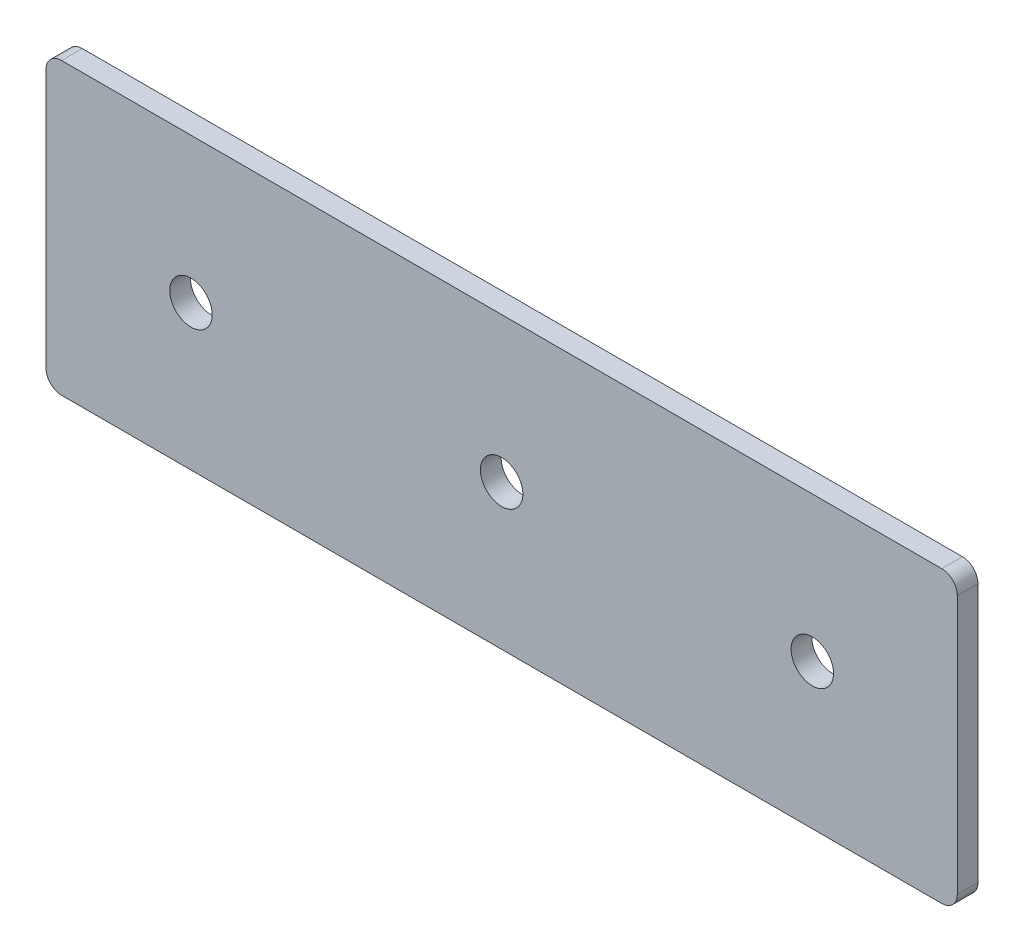
ISO-10303-21;
HEADER;
FILE_DESCRIPTION(('STEP AP214'),'2;1');
FILE_NAME('part.step','',(''),(''),'','','');
FILE_SCHEMA(('AUTOMOTIVE_DESIGN { 1 0 10303 214 1 1 1 1 }'));
ENDSEC;
DATA;
#1=APPLICATION_CONTEXT('core data for automotive mechanical design processes');
#2=APPLICATION_PROTOCOL_DEFINITION('international standard','automotive_design',2000,#1);
#3=PRODUCT_CONTEXT('',#1,'mechanical');
#4=PRODUCT('Part','Part','',(#3));
#5=PRODUCT_RELATED_PRODUCT_CATEGORY('part','',(#4));
#6=PRODUCT_DEFINITION_FORMATION('','',#4);
#7=PRODUCT_DEFINITION_CONTEXT('part definition',#1,'design');
#8=PRODUCT_DEFINITION('design','',#6,#7);
#9=PRODUCT_DEFINITION_SHAPE('','',#8);
#10=(LENGTH_UNIT() NAMED_UNIT(*) SI_UNIT(.MILLI.,.METRE.));
#11=(NAMED_UNIT(*) PLANE_ANGLE_UNIT() SI_UNIT($,.RADIAN.));
#12=(NAMED_UNIT(*) SI_UNIT($,.STERADIAN.) SOLID_ANGLE_UNIT());
#13=UNCERTAINTY_MEASURE_WITH_UNIT(LENGTH_MEASURE(1.E-05),#10,'distance_accuracy_value','');
#14=(GEOMETRIC_REPRESENTATION_CONTEXT(3) GLOBAL_UNCERTAINTY_ASSIGNED_CONTEXT((#13)) GLOBAL_UNIT_ASSIGNED_CONTEXT((#10,
#11,#12)) REPRESENTATION_CONTEXT('',''));
#15=CARTESIAN_POINT('',(0.,0.,0.));
#16=DIRECTION('',(0.,0.,1.));
#17=DIRECTION('',(1.,0.,0.));
#18=AXIS2_PLACEMENT_3D('',#15,#16,#17);
#19=CARTESIAN_POINT('',(0.,0.,4.));
#20=DIRECTION('',(0.,0.,1.));
#21=DIRECTION('',(1.,0.,0.));
#22=AXIS2_PLACEMENT_3D('',#19,#20,#21);
#23=PLANE('',#22);
#24=CARTESIAN_POINT('',(60.,0.,4.));
#25=DIRECTION('',(0.,0.,1.));
#26=DIRECTION('',(1.,0.,0.));
#27=AXIS2_PLACEMENT_3D('',#24,#25,#26);
#28=CIRCLE('',#27,4.09999999999999);
#29=CARTESIAN_POINT('',(64.1,0.,4.));
#30=VERTEX_POINT('',#29);
#31=EDGE_CURVE('E162',#30,#30,#28,.T.);
#32=ORIENTED_EDGE('',*,*,#31,.F.);
#33=EDGE_LOOP('',(#32));
#34=FACE_BOUND('',#33,.T.);
#35=DIRECTION('',(0.,-1.,0.));
#36=VECTOR('',#35,1.);
#37=CARTESIAN_POINT('',(-28.,28.,4.));
#38=LINE('',#37,#36);
#39=CARTESIAN_POINT('',(-28.,25.,4.));
#40=VERTEX_POINT('',#39);
#41=CARTESIAN_POINT('',(-28.,-25.,4.));
#42=VERTEX_POINT('',#41);
#43=EDGE_CURVE('E119',#40,#42,#38,.T.);
#44=ORIENTED_EDGE('',*,*,#43,.T.);
#45=CARTESIAN_POINT('',(-25.,-25.,4.));
#46=DIRECTION('',(0.,0.,1.));
#47=DIRECTION('',(1.,0.,0.));
#48=AXIS2_PLACEMENT_3D('',#45,#46,#47);
#49=CIRCLE('',#48,3.);
#50=CARTESIAN_POINT('',(-25.,-28.,4.));
#51=VERTEX_POINT('',#50);
#52=EDGE_CURVE('E134',#42,#51,#49,.T.);
#53=ORIENTED_EDGE('',*,*,#52,.T.);
#54=DIRECTION('',(1.,0.,0.));
#55=VECTOR('',#54,1.);
#56=CARTESIAN_POINT('',(-28.,-28.,4.));
#57=LINE('',#56,#55);
#58=CARTESIAN_POINT('',(145.,-28.,4.));
#59=VERTEX_POINT('',#58);
#60=EDGE_CURVE('E101',#51,#59,#57,.T.);
#61=ORIENTED_EDGE('',*,*,#60,.T.);
#62=CARTESIAN_POINT('',(145.,-25.,4.));
#63=DIRECTION('',(0.,0.,1.));
#64=DIRECTION('',(1.,0.,0.));
#65=AXIS2_PLACEMENT_3D('',#62,#63,#64);
#66=CIRCLE('',#65,3.);
#67=CARTESIAN_POINT('',(148.,-25.,4.));
#68=VERTEX_POINT('',#67);
#69=EDGE_CURVE('E132',#59,#68,#66,.T.);
#70=ORIENTED_EDGE('',*,*,#69,.T.);
#71=DIRECTION('',(0.,1.,0.));
#72=VECTOR('',#71,1.);
#73=CARTESIAN_POINT('',(148.,28.,4.));
#74=LINE('',#73,#72);
#75=CARTESIAN_POINT('',(148.,25.,4.));
#76=VERTEX_POINT('',#75);
#77=EDGE_CURVE('E145',#68,#76,#74,.T.);
#78=ORIENTED_EDGE('',*,*,#77,.T.);
#79=CARTESIAN_POINT('',(145.,25.,4.));
#80=DIRECTION('',(0.,0.,1.));
#81=DIRECTION('',(1.,0.,0.));
#82=AXIS2_PLACEMENT_3D('',#79,#80,#81);
#83=CIRCLE('',#82,3.);
#84=CARTESIAN_POINT('',(145.,28.,4.));
#85=VERTEX_POINT('',#84);
#86=EDGE_CURVE('E36',#76,#85,#83,.T.);
#87=ORIENTED_EDGE('',*,*,#86,.T.);
#88=DIRECTION('',(-1.,0.,0.));
#89=VECTOR('',#88,1.);
#90=CARTESIAN_POINT('',(-28.,28.,4.));
#91=LINE('',#90,#89);
#92=CARTESIAN_POINT('',(-25.,28.,4.));
#93=VERTEX_POINT('',#92);
#94=EDGE_CURVE('E120',#85,#93,#91,.T.);
#95=ORIENTED_EDGE('',*,*,#94,.T.);
#96=CARTESIAN_POINT('',(-25.,25.,4.));
#97=DIRECTION('',(0.,0.,1.));
#98=DIRECTION('',(1.,0.,0.));
#99=AXIS2_PLACEMENT_3D('',#96,#97,#98);
#100=CIRCLE('',#99,3.);
#101=EDGE_CURVE('E129',#93,#40,#100,.T.);
#102=ORIENTED_EDGE('',*,*,#101,.T.);
#103=EDGE_LOOP('',(#44,#53,#61,#70,#78,#87,#95,#102));
#104=FACE_BOUND('',#103,.T.);
#105=CARTESIAN_POINT('',(0.,0.,4.));
#106=DIRECTION('',(0.,0.,1.));
#107=DIRECTION('',(1.,0.,0.));
#108=AXIS2_PLACEMENT_3D('',#105,#106,#107);
#109=CIRCLE('',#108,4.1);
#110=CARTESIAN_POINT('',(4.1,0.,4.));
#111=VERTEX_POINT('',#110);
#112=EDGE_CURVE('E114',#111,#111,#109,.T.);
#113=ORIENTED_EDGE('',*,*,#112,.F.);
#114=EDGE_LOOP('',(#113));
#115=FACE_BOUND('',#114,.T.);
#116=CARTESIAN_POINT('',(120.,0.,4.));
#117=DIRECTION('',(0.,0.,1.));
#118=DIRECTION('',(1.,0.,0.));
#119=AXIS2_PLACEMENT_3D('',#116,#117,#118);
#120=CIRCLE('',#119,4.1);
#121=CARTESIAN_POINT('',(124.1,0.,4.));
#122=VERTEX_POINT('',#121);
#123=EDGE_CURVE('E168',#122,#122,#120,.T.);
#124=ORIENTED_EDGE('',*,*,#123,.F.);
#125=EDGE_LOOP('',(#124));
#126=FACE_BOUND('',#125,.T.);
#127=ADVANCED_FACE('F15',(#34,#104,#115,#126),#23,.T.);
#128=CARTESIAN_POINT('',(0.,0.,0.));
#129=DIRECTION('',(0.,0.,1.));
#130=DIRECTION('',(1.,0.,0.));
#131=AXIS2_PLACEMENT_3D('',#128,#129,#130);
#132=PLANE('',#131);
#133=DIRECTION('',(1.,0.,0.));
#134=VECTOR('',#133,1.);
#135=CARTESIAN_POINT('',(-28.,-28.,0.));
#136=LINE('',#135,#134);
#137=CARTESIAN_POINT('',(-25.,-28.,0.));
#138=VERTEX_POINT('',#137);
#139=CARTESIAN_POINT('',(145.,-28.,0.));
#140=VERTEX_POINT('',#139);
#141=EDGE_CURVE('E98',#138,#140,#136,.T.);
#142=ORIENTED_EDGE('',*,*,#141,.F.);
#143=CARTESIAN_POINT('',(-25.,-25.,0.));
#144=DIRECTION('',(0.,0.,1.));
#145=DIRECTION('',(1.,0.,0.));
#146=AXIS2_PLACEMENT_3D('',#143,#144,#145);
#147=CIRCLE('',#146,3.);
#148=CARTESIAN_POINT('',(-28.,-25.,0.));
#149=VERTEX_POINT('',#148);
#150=EDGE_CURVE('E81',#138,#149,#147,.F.);
#151=ORIENTED_EDGE('',*,*,#150,.T.);
#152=DIRECTION('',(0.,-1.,0.));
#153=VECTOR('',#152,1.);
#154=CARTESIAN_POINT('',(-28.,28.,0.));
#155=LINE('',#154,#153);
#156=CARTESIAN_POINT('',(-28.,25.,0.));
#157=VERTEX_POINT('',#156);
#158=EDGE_CURVE('E109',#157,#149,#155,.T.);
#159=ORIENTED_EDGE('',*,*,#158,.F.);
#160=CARTESIAN_POINT('',(-25.,25.,0.));
#161=DIRECTION('',(0.,0.,1.));
#162=DIRECTION('',(1.,0.,0.));
#163=AXIS2_PLACEMENT_3D('',#160,#161,#162);
#164=CIRCLE('',#163,3.);
#165=CARTESIAN_POINT('',(-25.,28.,0.));
#166=VERTEX_POINT('',#165);
#167=EDGE_CURVE('E102',#157,#166,#164,.F.);
#168=ORIENTED_EDGE('',*,*,#167,.T.);
#169=DIRECTION('',(-1.,0.,0.));
#170=VECTOR('',#169,1.);
#171=CARTESIAN_POINT('',(-28.,28.,0.));
#172=LINE('',#171,#170);
#173=CARTESIAN_POINT('',(145.,28.,0.));
#174=VERTEX_POINT('',#173);
#175=EDGE_CURVE('E112',#174,#166,#172,.T.);
#176=ORIENTED_EDGE('',*,*,#175,.F.);
#177=CARTESIAN_POINT('',(145.,25.,0.));
#178=DIRECTION('',(0.,0.,1.));
#179=DIRECTION('',(1.,0.,0.));
#180=AXIS2_PLACEMENT_3D('',#177,#178,#179);
#181=CIRCLE('',#180,3.);
#182=CARTESIAN_POINT('',(148.,25.,0.));
#183=VERTEX_POINT('',#182);
#184=EDGE_CURVE('E123',#174,#183,#181,.F.);
#185=ORIENTED_EDGE('',*,*,#184,.T.);
#186=DIRECTION('',(0.,1.,0.));
#187=VECTOR('',#186,1.);
#188=CARTESIAN_POINT('',(148.,28.,0.));
#189=LINE('',#188,#187);
#190=CARTESIAN_POINT('',(148.,-25.,0.));
#191=VERTEX_POINT('',#190);
#192=EDGE_CURVE('E108',#191,#183,#189,.T.);
#193=ORIENTED_EDGE('',*,*,#192,.F.);
#194=CARTESIAN_POINT('',(145.,-25.,0.));
#195=DIRECTION('',(0.,0.,1.));
#196=DIRECTION('',(1.,0.,0.));
#197=AXIS2_PLACEMENT_3D('',#194,#195,#196);
#198=CIRCLE('',#197,3.);
#199=EDGE_CURVE('E92',#191,#140,#198,.F.);
#200=ORIENTED_EDGE('',*,*,#199,.T.);
#201=EDGE_LOOP('',(#142,#151,#159,#168,#176,#185,#193,#200));
#202=FACE_BOUND('',#201,.T.);
#203=CARTESIAN_POINT('',(0.,0.,0.));
#204=DIRECTION('',(0.,0.,1.));
#205=DIRECTION('',(1.,0.,0.));
#206=AXIS2_PLACEMENT_3D('',#203,#204,#205);
#207=CIRCLE('',#206,4.1);
#208=CARTESIAN_POINT('',(4.1,0.,0.));
#209=VERTEX_POINT('',#208);
#210=EDGE_CURVE('E159',#209,#209,#207,.T.);
#211=ORIENTED_EDGE('',*,*,#210,.T.);
#212=EDGE_LOOP('',(#211));
#213=FACE_BOUND('',#212,.T.);
#214=CARTESIAN_POINT('',(60.,0.,0.));
#215=DIRECTION('',(0.,0.,1.));
#216=DIRECTION('',(1.,0.,0.));
#217=AXIS2_PLACEMENT_3D('',#214,#215,#216);
#218=CIRCLE('',#217,4.09999999999999);
#219=CARTESIAN_POINT('',(64.1,0.,0.));
#220=VERTEX_POINT('',#219);
#221=EDGE_CURVE('E165',#220,#220,#218,.T.);
#222=ORIENTED_EDGE('',*,*,#221,.T.);
#223=EDGE_LOOP('',(#222));
#224=FACE_BOUND('',#223,.T.);
#225=CARTESIAN_POINT('',(120.,0.,0.));
#226=DIRECTION('',(0.,0.,1.));
#227=DIRECTION('',(1.,0.,0.));
#228=AXIS2_PLACEMENT_3D('',#225,#226,#227);
#229=CIRCLE('',#228,4.1);
#230=CARTESIAN_POINT('',(124.1,0.,0.));
#231=VERTEX_POINT('',#230);
#232=EDGE_CURVE('E171',#231,#231,#229,.T.);
#233=ORIENTED_EDGE('',*,*,#232,.T.);
#234=EDGE_LOOP('',(#233));
#235=FACE_BOUND('',#234,.T.);
#236=ADVANCED_FACE('F105',(#202,#213,#224,#235),#132,.F.);
#237=CARTESIAN_POINT('',(-28.,28.,4.));
#238=DIRECTION('',(1.,0.,0.));
#239=DIRECTION('',(0.,1.,0.));
#240=AXIS2_PLACEMENT_3D('',#237,#238,#239);
#241=PLANE('',#240);
#242=ORIENTED_EDGE('',*,*,#158,.T.);
#243=DIRECTION('',(0.,0.,-1.));
#244=VECTOR('',#243,1.);
#245=CARTESIAN_POINT('',(-28.,-25.,4.));
#246=LINE('',#245,#244);
#247=EDGE_CURVE('E86',#149,#42,#246,.F.);
#248=ORIENTED_EDGE('',*,*,#247,.T.);
#249=ORIENTED_EDGE('',*,*,#43,.F.);
#250=DIRECTION('',(0.,0.,-1.));
#251=VECTOR('',#250,1.);
#252=CARTESIAN_POINT('',(-28.,25.,4.));
#253=LINE('',#252,#251);
#254=EDGE_CURVE('E91',#40,#157,#253,.T.);
#255=ORIENTED_EDGE('',*,*,#254,.T.);
#256=EDGE_LOOP('',(#242,#248,#249,#255));
#257=FACE_BOUND('',#256,.T.);
#258=ADVANCED_FACE('F187',(#257),#241,.F.);
#259=CARTESIAN_POINT('',(-28.,-28.,4.));
#260=DIRECTION('',(0.,1.,0.));
#261=DIRECTION('',(-1.,0.,0.));
#262=AXIS2_PLACEMENT_3D('',#259,#260,#261);
#263=PLANE('',#262);
#264=ORIENTED_EDGE('',*,*,#60,.F.);
#265=DIRECTION('',(0.,0.,-1.));
#266=VECTOR('',#265,1.);
#267=CARTESIAN_POINT('',(-25.,-28.,4.));
#268=LINE('',#267,#266);
#269=EDGE_CURVE('E85',#51,#138,#268,.T.);
#270=ORIENTED_EDGE('',*,*,#269,.T.);
#271=ORIENTED_EDGE('',*,*,#141,.T.);
#272=DIRECTION('',(0.,0.,-1.));
#273=VECTOR('',#272,1.);
#274=CARTESIAN_POINT('',(145.,-28.,4.));
#275=LINE('',#274,#273);
#276=EDGE_CURVE('E103',#140,#59,#275,.F.);
#277=ORIENTED_EDGE('',*,*,#276,.T.);
#278=EDGE_LOOP('',(#264,#270,#271,#277));
#279=FACE_BOUND('',#278,.T.);
#280=ADVANCED_FACE('F97',(#279),#263,.F.);
#281=CARTESIAN_POINT('',(148.,28.,4.));
#282=DIRECTION('',(-1.,0.,0.));
#283=DIRECTION('',(0.,0.,1.));
#284=AXIS2_PLACEMENT_3D('',#281,#282,#283);
#285=PLANE('',#284);
#286=ORIENTED_EDGE('',*,*,#77,.F.);
#287=DIRECTION('',(0.,0.,-1.));
#288=VECTOR('',#287,1.);
#289=CARTESIAN_POINT('',(148.,-25.,4.));
#290=LINE('',#289,#288);
#291=EDGE_CURVE('E138',#68,#191,#290,.T.);
#292=ORIENTED_EDGE('',*,*,#291,.T.);
#293=ORIENTED_EDGE('',*,*,#192,.T.);
#294=DIRECTION('',(0.,0.,-1.));
#295=VECTOR('',#294,1.);
#296=CARTESIAN_POINT('',(148.,25.,4.));
#297=LINE('',#296,#295);
#298=EDGE_CURVE('E136',#183,#76,#297,.F.);
#299=ORIENTED_EDGE('',*,*,#298,.T.);
#300=EDGE_LOOP('',(#286,#292,#293,#299));
#301=FACE_BOUND('',#300,.T.);
#302=ADVANCED_FACE('F143',(#301),#285,.F.);
#303=CARTESIAN_POINT('',(-28.,28.,4.));
#304=DIRECTION('',(0.,-1.,0.));
#305=DIRECTION('',(1.,0.,0.));
#306=AXIS2_PLACEMENT_3D('',#303,#304,#305);
#307=PLANE('',#306);
#308=ORIENTED_EDGE('',*,*,#94,.F.);
#309=DIRECTION('',(0.,0.,-1.));
#310=VECTOR('',#309,1.);
#311=CARTESIAN_POINT('',(145.,28.,4.));
#312=LINE('',#311,#310);
#313=EDGE_CURVE('E9',#85,#174,#312,.T.);
#314=ORIENTED_EDGE('',*,*,#313,.T.);
#315=ORIENTED_EDGE('',*,*,#175,.T.);
#316=DIRECTION('',(0.,0.,-1.));
#317=VECTOR('',#316,1.);
#318=CARTESIAN_POINT('',(-25.,28.,4.));
#319=LINE('',#318,#317);
#320=EDGE_CURVE('E23',#166,#93,#319,.F.);
#321=ORIENTED_EDGE('',*,*,#320,.T.);
#322=EDGE_LOOP('',(#308,#314,#315,#321));
#323=FACE_BOUND('',#322,.T.);
#324=ADVANCED_FACE('F152',(#323),#307,.F.);
#325=CARTESIAN_POINT('',(0.,0.,4.));
#326=DIRECTION('',(0.,0.,-1.));
#327=DIRECTION('',(-1.,0.,0.));
#328=AXIS2_PLACEMENT_3D('',#325,#326,#327);
#329=CYLINDRICAL_SURFACE('',#328,4.1);
#330=ORIENTED_EDGE('',*,*,#112,.T.);
#331=EDGE_LOOP('',(#330));
#332=FACE_BOUND('',#331,.T.);
#333=ORIENTED_EDGE('',*,*,#210,.F.);
#334=EDGE_LOOP('',(#333));
#335=FACE_BOUND('',#334,.T.);
#336=ADVANCED_FACE('F191',(#332,#335),#329,.F.);
#337=CARTESIAN_POINT('',(60.,0.,4.));
#338=DIRECTION('',(0.,0.,-1.));
#339=DIRECTION('',(-1.,0.,0.));
#340=AXIS2_PLACEMENT_3D('',#337,#338,#339);
#341=CYLINDRICAL_SURFACE('',#340,4.09999999999999);
#342=ORIENTED_EDGE('',*,*,#31,.T.);
#343=EDGE_LOOP('',(#342));
#344=FACE_BOUND('',#343,.T.);
#345=ORIENTED_EDGE('',*,*,#221,.F.);
#346=EDGE_LOOP('',(#345));
#347=FACE_BOUND('',#346,.T.);
#348=ADVANCED_FACE('F221',(#344,#347),#341,.F.);
#349=CARTESIAN_POINT('',(120.,0.,4.));
#350=DIRECTION('',(0.,0.,-1.));
#351=DIRECTION('',(-1.,0.,0.));
#352=AXIS2_PLACEMENT_3D('',#349,#350,#351);
#353=CYLINDRICAL_SURFACE('',#352,4.1);
#354=ORIENTED_EDGE('',*,*,#123,.T.);
#355=EDGE_LOOP('',(#354));
#356=FACE_BOUND('',#355,.T.);
#357=ORIENTED_EDGE('',*,*,#232,.F.);
#358=EDGE_LOOP('',(#357));
#359=FACE_BOUND('',#358,.T.);
#360=ADVANCED_FACE('F177',(#356,#359),#353,.F.);
#361=CARTESIAN_POINT('',(-25.,-25.,4.));
#362=DIRECTION('',(0.,0.,-1.));
#363=DIRECTION('',(-1.,0.,0.));
#364=AXIS2_PLACEMENT_3D('',#361,#362,#363);
#365=CYLINDRICAL_SURFACE('',#364,3.);
#366=ORIENTED_EDGE('',*,*,#52,.F.);
#367=ORIENTED_EDGE('',*,*,#247,.F.);
#368=ORIENTED_EDGE('',*,*,#150,.F.);
#369=ORIENTED_EDGE('',*,*,#269,.F.);
#370=EDGE_LOOP('',(#366,#367,#368,#369));
#371=FACE_BOUND('',#370,.T.);
#372=ADVANCED_FACE('F84',(#371),#365,.T.);
#373=CARTESIAN_POINT('',(145.,-25.,4.));
#374=DIRECTION('',(0.,0.,-1.));
#375=DIRECTION('',(-1.,0.,0.));
#376=AXIS2_PLACEMENT_3D('',#373,#374,#375);
#377=CYLINDRICAL_SURFACE('',#376,3.);
#378=ORIENTED_EDGE('',*,*,#69,.F.);
#379=ORIENTED_EDGE('',*,*,#276,.F.);
#380=ORIENTED_EDGE('',*,*,#199,.F.);
#381=ORIENTED_EDGE('',*,*,#291,.F.);
#382=EDGE_LOOP('',(#378,#379,#380,#381));
#383=FACE_BOUND('',#382,.T.);
#384=ADVANCED_FACE('F205',(#383),#377,.T.);
#385=CARTESIAN_POINT('',(145.,25.,4.));
#386=DIRECTION('',(0.,0.,-1.));
#387=DIRECTION('',(-1.,0.,0.));
#388=AXIS2_PLACEMENT_3D('',#385,#386,#387);
#389=CYLINDRICAL_SURFACE('',#388,3.);
#390=ORIENTED_EDGE('',*,*,#86,.F.);
#391=ORIENTED_EDGE('',*,*,#298,.F.);
#392=ORIENTED_EDGE('',*,*,#184,.F.);
#393=ORIENTED_EDGE('',*,*,#313,.F.);
#394=EDGE_LOOP('',(#390,#391,#392,#393));
#395=FACE_BOUND('',#394,.T.);
#396=ADVANCED_FACE('F151',(#395),#389,.T.);
#397=CARTESIAN_POINT('',(-25.,25.,4.));
#398=DIRECTION('',(0.,0.,-1.));
#399=DIRECTION('',(-1.,0.,0.));
#400=AXIS2_PLACEMENT_3D('',#397,#398,#399);
#401=CYLINDRICAL_SURFACE('',#400,3.);
#402=ORIENTED_EDGE('',*,*,#101,.F.);
#403=ORIENTED_EDGE('',*,*,#320,.F.);
#404=ORIENTED_EDGE('',*,*,#167,.F.);
#405=ORIENTED_EDGE('',*,*,#254,.F.);
#406=EDGE_LOOP('',(#402,#403,#404,#405));
#407=FACE_BOUND('',#406,.T.);
#408=ADVANCED_FACE('F17',(#407),#401,.T.);
#409=CLOSED_SHELL('',(#127,#236,#258,#280,#302,#324,#336,#348,#360,#372,#384,#396,#408));
#410=MANIFOLD_SOLID_BREP('B1',#409);
#411=ADVANCED_BREP_SHAPE_REPRESENTATION('',(#18,#410),#14);
#412=SHAPE_DEFINITION_REPRESENTATION(#9,#411);
ENDSEC;
END-ISO-10303-21;
